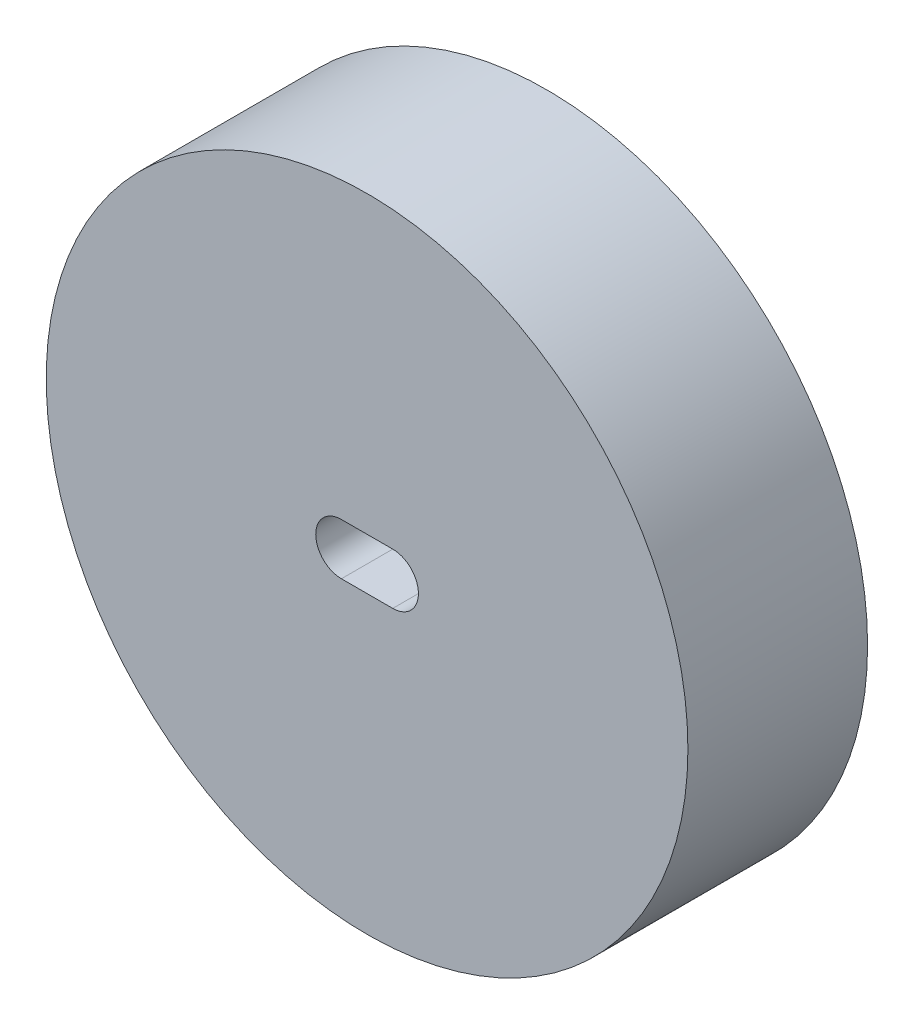
ISO-10303-21;
HEADER;
FILE_DESCRIPTION(('STEP AP214'),'2;1');
FILE_NAME('part.step','',(''),(''),'','','');
FILE_SCHEMA(('AUTOMOTIVE_DESIGN { 1 0 10303 214 1 1 1 1 }'));
ENDSEC;
DATA;
#1=APPLICATION_CONTEXT('core data for automotive mechanical design processes');
#2=APPLICATION_PROTOCOL_DEFINITION('international standard','automotive_design',2000,#1);
#3=PRODUCT_CONTEXT('',#1,'mechanical');
#4=PRODUCT('Part','Part','',(#3));
#5=PRODUCT_RELATED_PRODUCT_CATEGORY('part','',(#4));
#6=PRODUCT_DEFINITION_FORMATION('','',#4);
#7=PRODUCT_DEFINITION_CONTEXT('part definition',#1,'design');
#8=PRODUCT_DEFINITION('design','',#6,#7);
#9=PRODUCT_DEFINITION_SHAPE('','',#8);
#10=(LENGTH_UNIT() NAMED_UNIT(*) SI_UNIT(.MILLI.,.METRE.));
#11=(NAMED_UNIT(*) PLANE_ANGLE_UNIT() SI_UNIT($,.RADIAN.));
#12=(NAMED_UNIT(*) SI_UNIT($,.STERADIAN.) SOLID_ANGLE_UNIT());
#13=UNCERTAINTY_MEASURE_WITH_UNIT(LENGTH_MEASURE(1.E-05),#10,'distance_accuracy_value','');
#14=(GEOMETRIC_REPRESENTATION_CONTEXT(3) GLOBAL_UNCERTAINTY_ASSIGNED_CONTEXT((#13)) GLOBAL_UNIT_ASSIGNED_CONTEXT((#10,
#11,#12)) REPRESENTATION_CONTEXT('',''));
#15=CARTESIAN_POINT('',(0.,0.,0.));
#16=DIRECTION('',(0.,0.,1.));
#17=DIRECTION('',(1.,0.,0.));
#18=AXIS2_PLACEMENT_3D('',#15,#16,#17);
#19=CARTESIAN_POINT('',(0.,0.,3.5));
#20=DIRECTION('',(0.,0.,1.));
#21=DIRECTION('',(1.,0.,0.));
#22=AXIS2_PLACEMENT_3D('',#19,#20,#21);
#23=PLANE('',#22);
#24=CARTESIAN_POINT('',(0.,0.,3.5));
#25=DIRECTION('',(0.,0.,1.));
#26=DIRECTION('',(1.,0.,0.));
#27=AXIS2_PLACEMENT_3D('',#24,#25,#26);
#28=CIRCLE('',#27,12.5);
#29=CARTESIAN_POINT('',(12.5,0.,3.5));
#30=VERTEX_POINT('',#29);
#31=EDGE_CURVE('E11',#30,#30,#28,.T.);
#32=ORIENTED_EDGE('',*,*,#31,.T.);
#33=EDGE_LOOP('',(#32));
#34=FACE_BOUND('',#33,.T.);
#35=DIRECTION('',(-1.,0.,0.));
#36=VECTOR('',#35,1.);
#37=CARTESIAN_POINT('',(0.999999999999999,1.,3.5));
#38=LINE('',#37,#36);
#39=CARTESIAN_POINT('',(0.999999999999999,1.,3.5));
#40=VERTEX_POINT('',#39);
#41=CARTESIAN_POINT('',(-1.,1.,3.5));
#42=VERTEX_POINT('',#41);
#43=EDGE_CURVE('E82',#40,#42,#38,.T.);
#44=ORIENTED_EDGE('',*,*,#43,.F.);
#45=CARTESIAN_POINT('',(1.,0.,3.5));
#46=DIRECTION('',(0.,0.,1.));
#47=DIRECTION('',(1.,0.,0.));
#48=AXIS2_PLACEMENT_3D('',#45,#46,#47);
#49=CIRCLE('',#48,1.);
#50=CARTESIAN_POINT('',(1.,-0.999999999999999,3.5));
#51=VERTEX_POINT('',#50);
#52=EDGE_CURVE('E74',#51,#40,#49,.T.);
#53=ORIENTED_EDGE('',*,*,#52,.F.);
#54=DIRECTION('',(1.,0.,0.));
#55=VECTOR('',#54,1.);
#56=CARTESIAN_POINT('',(1.,-0.999999999999999,3.5));
#57=LINE('',#56,#55);
#58=CARTESIAN_POINT('',(-1.,-1.,3.5));
#59=VERTEX_POINT('',#58);
#60=EDGE_CURVE('E95',#59,#51,#57,.T.);
#61=ORIENTED_EDGE('',*,*,#60,.F.);
#62=CARTESIAN_POINT('',(-1.,0.,3.5));
#63=DIRECTION('',(0.,0.,1.));
#64=DIRECTION('',(1.,0.,0.));
#65=AXIS2_PLACEMENT_3D('',#62,#63,#64);
#66=CIRCLE('',#65,1.);
#67=EDGE_CURVE('E93',#42,#59,#66,.T.);
#68=ORIENTED_EDGE('',*,*,#67,.F.);
#69=EDGE_LOOP('',(#44,#53,#61,#68));
#70=FACE_BOUND('',#69,.T.);
#71=ADVANCED_FACE('F33',(#34,#70),#23,.T.);
#72=CARTESIAN_POINT('',(0.,0.,-3.5));
#73=DIRECTION('',(0.,0.,1.));
#74=DIRECTION('',(1.,0.,0.));
#75=AXIS2_PLACEMENT_3D('',#72,#73,#74);
#76=PLANE('',#75);
#77=CARTESIAN_POINT('',(0.,0.,-3.5));
#78=DIRECTION('',(0.,0.,1.));
#79=DIRECTION('',(1.,0.,0.));
#80=AXIS2_PLACEMENT_3D('',#77,#78,#79);
#81=CIRCLE('',#80,12.5);
#82=CARTESIAN_POINT('',(12.5,0.,-3.5));
#83=VERTEX_POINT('',#82);
#84=EDGE_CURVE('E37',#83,#83,#81,.T.);
#85=ORIENTED_EDGE('',*,*,#84,.F.);
#86=EDGE_LOOP('',(#85));
#87=FACE_BOUND('',#86,.T.);
#88=CARTESIAN_POINT('',(1.,0.,-3.5));
#89=DIRECTION('',(0.,0.,1.));
#90=DIRECTION('',(1.,0.,0.));
#91=AXIS2_PLACEMENT_3D('',#88,#89,#90);
#92=CIRCLE('',#91,1.);
#93=CARTESIAN_POINT('',(1.,-0.999999999999999,-3.5));
#94=VERTEX_POINT('',#93);
#95=CARTESIAN_POINT('',(0.999999999999999,1.,-3.5));
#96=VERTEX_POINT('',#95);
#97=EDGE_CURVE('E56',#94,#96,#92,.T.);
#98=ORIENTED_EDGE('',*,*,#97,.T.);
#99=DIRECTION('',(-1.,0.,0.));
#100=VECTOR('',#99,1.);
#101=CARTESIAN_POINT('',(0.999999999999999,1.,-3.5));
#102=LINE('',#101,#100);
#103=CARTESIAN_POINT('',(-1.,1.,-3.5));
#104=VERTEX_POINT('',#103);
#105=EDGE_CURVE('E89',#96,#104,#102,.T.);
#106=ORIENTED_EDGE('',*,*,#105,.T.);
#107=CARTESIAN_POINT('',(-1.,0.,-3.5));
#108=DIRECTION('',(0.,0.,1.));
#109=DIRECTION('',(1.,0.,0.));
#110=AXIS2_PLACEMENT_3D('',#107,#108,#109);
#111=CIRCLE('',#110,1.);
#112=CARTESIAN_POINT('',(-1.,-1.,-3.5));
#113=VERTEX_POINT('',#112);
#114=EDGE_CURVE('E101',#104,#113,#111,.T.);
#115=ORIENTED_EDGE('',*,*,#114,.T.);
#116=DIRECTION('',(1.,0.,0.));
#117=VECTOR('',#116,1.);
#118=CARTESIAN_POINT('',(1.,-0.999999999999999,-3.5));
#119=LINE('',#118,#117);
#120=EDGE_CURVE('E83',#113,#94,#119,.T.);
#121=ORIENTED_EDGE('',*,*,#120,.T.);
#122=EDGE_LOOP('',(#98,#106,#115,#121));
#123=FACE_BOUND('',#122,.T.);
#124=ADVANCED_FACE('F112',(#87,#123),#76,.F.);
#125=CARTESIAN_POINT('',(0.,0.,3.5));
#126=DIRECTION('',(0.,0.,-1.));
#127=DIRECTION('',(-1.,0.,0.));
#128=AXIS2_PLACEMENT_3D('',#125,#126,#127);
#129=CYLINDRICAL_SURFACE('',#128,12.5);
#130=ORIENTED_EDGE('',*,*,#31,.F.);
#131=EDGE_LOOP('',(#130));
#132=FACE_BOUND('',#131,.T.);
#133=ORIENTED_EDGE('',*,*,#84,.T.);
#134=EDGE_LOOP('',(#133));
#135=FACE_BOUND('',#134,.T.);
#136=ADVANCED_FACE('F35',(#132,#135),#129,.T.);
#137=CARTESIAN_POINT('',(1.,0.,3.5));
#138=DIRECTION('',(0.,0.,-1.));
#139=DIRECTION('',(-1.,0.,0.));
#140=AXIS2_PLACEMENT_3D('',#137,#138,#139);
#141=CYLINDRICAL_SURFACE('',#140,1.);
#142=ORIENTED_EDGE('',*,*,#97,.F.);
#143=DIRECTION('',(0.,0.,-1.));
#144=VECTOR('',#143,1.);
#145=CARTESIAN_POINT('',(1.,-0.999999999999999,3.5));
#146=LINE('',#145,#144);
#147=EDGE_CURVE('E78',#51,#94,#146,.T.);
#148=ORIENTED_EDGE('',*,*,#147,.F.);
#149=ORIENTED_EDGE('',*,*,#52,.T.);
#150=DIRECTION('',(0.,0.,-1.));
#151=VECTOR('',#150,1.);
#152=CARTESIAN_POINT('',(0.999999999999999,1.,3.5));
#153=LINE('',#152,#151);
#154=EDGE_CURVE('E77',#40,#96,#153,.T.);
#155=ORIENTED_EDGE('',*,*,#154,.T.);
#156=EDGE_LOOP('',(#142,#148,#149,#155));
#157=FACE_BOUND('',#156,.T.);
#158=ADVANCED_FACE('F76',(#157),#141,.F.);
#159=CARTESIAN_POINT('',(0.999999999999999,1.,3.5));
#160=DIRECTION('',(0.,-1.,0.));
#161=DIRECTION('',(1.,0.,0.));
#162=AXIS2_PLACEMENT_3D('',#159,#160,#161);
#163=PLANE('',#162);
#164=ORIENTED_EDGE('',*,*,#105,.F.);
#165=ORIENTED_EDGE('',*,*,#154,.F.);
#166=ORIENTED_EDGE('',*,*,#43,.T.);
#167=DIRECTION('',(0.,0.,-1.));
#168=VECTOR('',#167,1.);
#169=CARTESIAN_POINT('',(-1.,1.,3.5));
#170=LINE('',#169,#168);
#171=EDGE_CURVE('E90',#42,#104,#170,.T.);
#172=ORIENTED_EDGE('',*,*,#171,.T.);
#173=EDGE_LOOP('',(#164,#165,#166,#172));
#174=FACE_BOUND('',#173,.T.);
#175=ADVANCED_FACE('F86',(#174),#163,.T.);
#176=CARTESIAN_POINT('',(-1.,0.,3.5));
#177=DIRECTION('',(0.,0.,-1.));
#178=DIRECTION('',(-1.,0.,0.));
#179=AXIS2_PLACEMENT_3D('',#176,#177,#178);
#180=CYLINDRICAL_SURFACE('',#179,1.);
#181=ORIENTED_EDGE('',*,*,#114,.F.);
#182=ORIENTED_EDGE('',*,*,#171,.F.);
#183=ORIENTED_EDGE('',*,*,#67,.T.);
#184=DIRECTION('',(0.,0.,-1.));
#185=VECTOR('',#184,1.);
#186=CARTESIAN_POINT('',(-1.,-1.,3.5));
#187=LINE('',#186,#185);
#188=EDGE_CURVE('E48',#59,#113,#187,.T.);
#189=ORIENTED_EDGE('',*,*,#188,.T.);
#190=EDGE_LOOP('',(#181,#182,#183,#189));
#191=FACE_BOUND('',#190,.T.);
#192=ADVANCED_FACE('F110',(#191),#180,.F.);
#193=CARTESIAN_POINT('',(1.,-0.999999999999999,3.5));
#194=DIRECTION('',(0.,1.,0.));
#195=DIRECTION('',(-1.,0.,0.));
#196=AXIS2_PLACEMENT_3D('',#193,#194,#195);
#197=PLANE('',#196);
#198=ORIENTED_EDGE('',*,*,#120,.F.);
#199=ORIENTED_EDGE('',*,*,#188,.F.);
#200=ORIENTED_EDGE('',*,*,#60,.T.);
#201=ORIENTED_EDGE('',*,*,#147,.T.);
#202=EDGE_LOOP('',(#198,#199,#200,#201));
#203=FACE_BOUND('',#202,.T.);
#204=ADVANCED_FACE('F113',(#203),#197,.T.);
#205=CLOSED_SHELL('',(#71,#124,#136,#158,#175,#192,#204));
#206=MANIFOLD_SOLID_BREP('B2',#205);
#207=ADVANCED_BREP_SHAPE_REPRESENTATION('',(#18,#206),#14);
#208=SHAPE_DEFINITION_REPRESENTATION(#9,#207);
ENDSEC;
END-ISO-10303-21;
